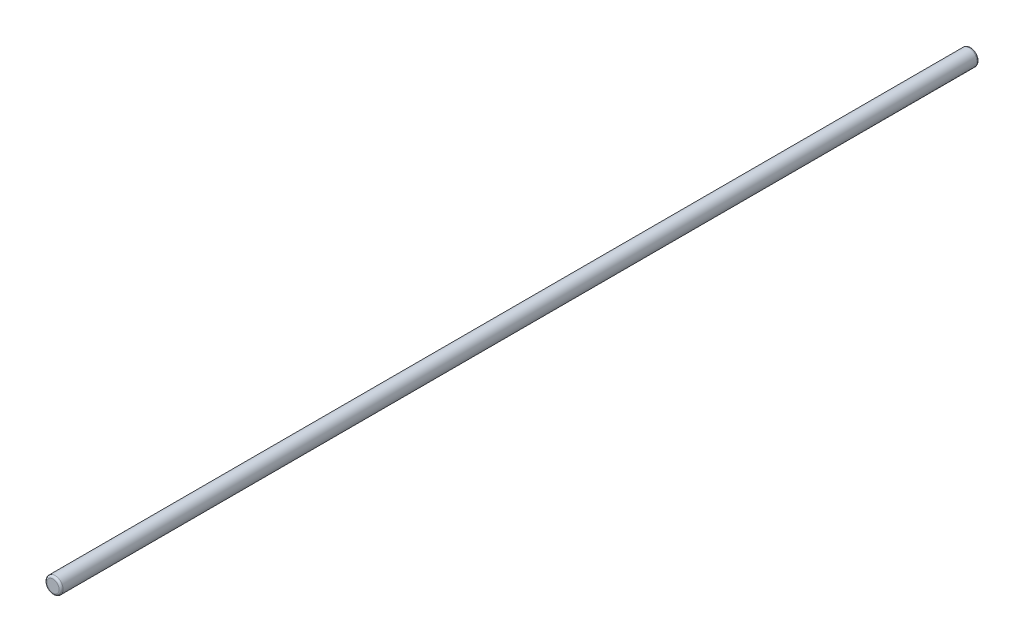
ISO-10303-21;
HEADER;
FILE_DESCRIPTION(('STEP AP214'),'2;1');
FILE_NAME('part.step','',(''),(''),'','','');
FILE_SCHEMA(('AUTOMOTIVE_DESIGN { 1 0 10303 214 1 1 1 1 }'));
ENDSEC;
DATA;
#1=APPLICATION_CONTEXT('core data for automotive mechanical design processes');
#2=APPLICATION_PROTOCOL_DEFINITION('international standard','automotive_design',2000,#1);
#3=PRODUCT_CONTEXT('',#1,'mechanical');
#4=PRODUCT('Part','Part','',(#3));
#5=PRODUCT_RELATED_PRODUCT_CATEGORY('part','',(#4));
#6=PRODUCT_DEFINITION_FORMATION('','',#4);
#7=PRODUCT_DEFINITION_CONTEXT('part definition',#1,'design');
#8=PRODUCT_DEFINITION('design','',#6,#7);
#9=PRODUCT_DEFINITION_SHAPE('','',#8);
#10=(LENGTH_UNIT() NAMED_UNIT(*) SI_UNIT(.MILLI.,.METRE.));
#11=(NAMED_UNIT(*) PLANE_ANGLE_UNIT() SI_UNIT($,.RADIAN.));
#12=(NAMED_UNIT(*) SI_UNIT($,.STERADIAN.) SOLID_ANGLE_UNIT());
#13=UNCERTAINTY_MEASURE_WITH_UNIT(LENGTH_MEASURE(1.E-05),#10,'distance_accuracy_value','');
#14=(GEOMETRIC_REPRESENTATION_CONTEXT(3) GLOBAL_UNCERTAINTY_ASSIGNED_CONTEXT((#13)) GLOBAL_UNIT_ASSIGNED_CONTEXT((#10,
#11,#12)) REPRESENTATION_CONTEXT('',''));
#15=CARTESIAN_POINT('',(0.,0.,0.));
#16=DIRECTION('',(0.,0.,1.));
#17=DIRECTION('',(1.,0.,0.));
#18=AXIS2_PLACEMENT_3D('',#15,#16,#17);
#19=CARTESIAN_POINT('',(0.,0.,-225.));
#20=DIRECTION('',(0.,0.,1.));
#21=DIRECTION('',(1.,0.,0.));
#22=AXIS2_PLACEMENT_3D('',#19,#20,#21);
#23=CYLINDRICAL_SURFACE('',#22,4.);
#24=CARTESIAN_POINT('',(0.,0.,224.));
#25=DIRECTION('',(0.,0.,1.));
#26=DIRECTION('',(1.,0.,0.));
#27=AXIS2_PLACEMENT_3D('',#24,#25,#26);
#28=CIRCLE('',#27,4.);
#29=CARTESIAN_POINT('',(4.,0.,224.));
#30=VERTEX_POINT('',#29);
#31=EDGE_CURVE('E10',#30,#30,#28,.F.);
#32=ORIENTED_EDGE('',*,*,#31,.T.);
#33=EDGE_LOOP('',(#32));
#34=FACE_BOUND('',#33,.T.);
#35=CARTESIAN_POINT('',(0.,0.,-224.));
#36=DIRECTION('',(0.,0.,1.));
#37=DIRECTION('',(1.,0.,0.));
#38=AXIS2_PLACEMENT_3D('',#35,#36,#37);
#39=CIRCLE('',#38,4.);
#40=CARTESIAN_POINT('',(4.,0.,-224.));
#41=VERTEX_POINT('',#40);
#42=EDGE_CURVE('E44',#41,#41,#39,.T.);
#43=ORIENTED_EDGE('',*,*,#42,.T.);
#44=EDGE_LOOP('',(#43));
#45=FACE_BOUND('',#44,.T.);
#46=ADVANCED_FACE('F29',(#34,#45),#23,.T.);
#47=CARTESIAN_POINT('',(0.,0.,-225.));
#48=DIRECTION('',(0.,0.,1.));
#49=DIRECTION('',(1.,0.,0.));
#50=AXIS2_PLACEMENT_3D('',#47,#48,#49);
#51=PLANE('',#50);
#52=CARTESIAN_POINT('',(0.,0.,-225.));
#53=DIRECTION('',(0.,0.,1.));
#54=DIRECTION('',(1.,0.,0.));
#55=AXIS2_PLACEMENT_3D('',#52,#53,#54);
#56=CIRCLE('',#55,3.);
#57=CARTESIAN_POINT('',(3.,0.,-225.));
#58=VERTEX_POINT('',#57);
#59=EDGE_CURVE('E40',#58,#58,#56,.F.);
#60=ORIENTED_EDGE('',*,*,#59,.T.);
#61=EDGE_LOOP('',(#60));
#62=FACE_BOUND('',#61,.T.);
#63=ADVANCED_FACE('F60',(#62),#51,.F.);
#64=CARTESIAN_POINT('',(0.,0.,225.));
#65=DIRECTION('',(0.,0.,1.));
#66=DIRECTION('',(1.,0.,0.));
#67=AXIS2_PLACEMENT_3D('',#64,#65,#66);
#68=PLANE('',#67);
#69=CARTESIAN_POINT('',(0.,0.,225.));
#70=DIRECTION('',(0.,0.,1.));
#71=DIRECTION('',(1.,0.,0.));
#72=AXIS2_PLACEMENT_3D('',#69,#70,#71);
#73=CIRCLE('',#72,3.);
#74=CARTESIAN_POINT('',(3.,0.,225.));
#75=VERTEX_POINT('',#74);
#76=EDGE_CURVE('E36',#75,#75,#73,.T.);
#77=ORIENTED_EDGE('',*,*,#76,.T.);
#78=EDGE_LOOP('',(#77));
#79=FACE_BOUND('',#78,.T.);
#80=ADVANCED_FACE('F53',(#79),#68,.T.);
#81=CARTESIAN_POINT('',(0.,0.,-224.));
#82=DIRECTION('',(0.,0.,1.));
#83=DIRECTION('',(1.,0.,0.));
#84=AXIS2_PLACEMENT_3D('',#81,#82,#83);
#85=TOROIDAL_SURFACE('',#84,3.,1.);
#86=ORIENTED_EDGE('',*,*,#59,.F.);
#87=EDGE_LOOP('',(#86));
#88=FACE_BOUND('',#87,.T.);
#89=ORIENTED_EDGE('',*,*,#42,.F.);
#90=EDGE_LOOP('',(#89));
#91=FACE_BOUND('',#90,.T.);
#92=ADVANCED_FACE('F51',(#88,#91),#85,.T.);
#93=CARTESIAN_POINT('',(0.,0.,224.));
#94=DIRECTION('',(0.,0.,1.));
#95=DIRECTION('',(1.,0.,0.));
#96=AXIS2_PLACEMENT_3D('',#93,#94,#95);
#97=TOROIDAL_SURFACE('',#96,3.,1.);
#98=ORIENTED_EDGE('',*,*,#31,.F.);
#99=EDGE_LOOP('',(#98));
#100=FACE_BOUND('',#99,.T.);
#101=ORIENTED_EDGE('',*,*,#76,.F.);
#102=EDGE_LOOP('',(#101));
#103=FACE_BOUND('',#102,.T.);
#104=ADVANCED_FACE('F31',(#100,#103),#97,.T.);
#105=CLOSED_SHELL('',(#46,#63,#80,#92,#104));
#106=MANIFOLD_SOLID_BREP('B2',#105);
#107=ADVANCED_BREP_SHAPE_REPRESENTATION('',(#18,#106),#14);
#108=SHAPE_DEFINITION_REPRESENTATION(#9,#107);
ENDSEC;
END-ISO-10303-21;
